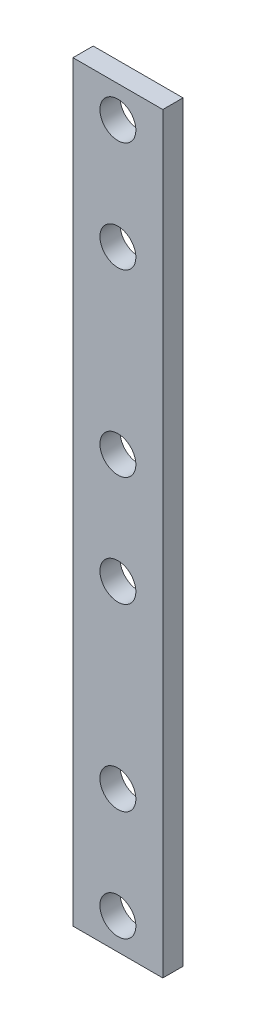
ISO-10303-21;
HEADER;
FILE_DESCRIPTION(('STEP AP214'),'2;1');
FILE_NAME('part.step','',(''),(''),'','','');
FILE_SCHEMA(('AUTOMOTIVE_DESIGN { 1 0 10303 214 1 1 1 1 }'));
ENDSEC;
DATA;
#1=APPLICATION_CONTEXT('core data for automotive mechanical design processes');
#2=APPLICATION_PROTOCOL_DEFINITION('international standard','automotive_design',2000,#1);
#3=PRODUCT_CONTEXT('',#1,'mechanical');
#4=PRODUCT('Part','Part','',(#3));
#5=PRODUCT_RELATED_PRODUCT_CATEGORY('part','',(#4));
#6=PRODUCT_DEFINITION_FORMATION('','',#4);
#7=PRODUCT_DEFINITION_CONTEXT('part definition',#1,'design');
#8=PRODUCT_DEFINITION('design','',#6,#7);
#9=PRODUCT_DEFINITION_SHAPE('','',#8);
#10=(LENGTH_UNIT() NAMED_UNIT(*) SI_UNIT(.MILLI.,.METRE.));
#11=(NAMED_UNIT(*) PLANE_ANGLE_UNIT() SI_UNIT($,.RADIAN.));
#12=(NAMED_UNIT(*) SI_UNIT($,.STERADIAN.) SOLID_ANGLE_UNIT());
#13=UNCERTAINTY_MEASURE_WITH_UNIT(LENGTH_MEASURE(1.E-05),#10,'distance_accuracy_value','');
#14=(GEOMETRIC_REPRESENTATION_CONTEXT(3) GLOBAL_UNCERTAINTY_ASSIGNED_CONTEXT((#13)) GLOBAL_UNIT_ASSIGNED_CONTEXT((#10,
#11,#12)) REPRESENTATION_CONTEXT('',''));
#15=CARTESIAN_POINT('',(0.,0.,0.));
#16=DIRECTION('',(0.,0.,1.));
#17=DIRECTION('',(1.,0.,0.));
#18=AXIS2_PLACEMENT_3D('',#15,#16,#17);
#19=CARTESIAN_POINT('',(36.3420104423946,-82.5000000000001,4.5));
#20=DIRECTION('',(-1.,0.,0.));
#21=DIRECTION('',(0.,0.,1.));
#22=AXIS2_PLACEMENT_3D('',#19,#20,#21);
#23=PLANE('',#22);
#24=DIRECTION('',(0.,1.,0.));
#25=VECTOR('',#24,1.);
#26=CARTESIAN_POINT('',(36.3420104423946,-82.5000000000001,0.));
#27=LINE('',#26,#25);
#28=CARTESIAN_POINT('',(36.3420104423946,-82.5000000000001,0.));
#29=VERTEX_POINT('',#28);
#30=CARTESIAN_POINT('',(36.3420104423946,84.9999999999999,0.));
#31=VERTEX_POINT('',#30);
#32=EDGE_CURVE('E96',#29,#31,#27,.T.);
#33=ORIENTED_EDGE('',*,*,#32,.T.);
#34=DIRECTION('',(0.,0.,-1.));
#35=VECTOR('',#34,1.);
#36=CARTESIAN_POINT('',(36.3420104423946,84.9999999999999,4.5));
#37=LINE('',#36,#35);
#38=CARTESIAN_POINT('',(36.3420104423946,84.9999999999999,4.5));
#39=VERTEX_POINT('',#38);
#40=EDGE_CURVE('E11',#39,#31,#37,.T.);
#41=ORIENTED_EDGE('',*,*,#40,.F.);
#42=DIRECTION('',(0.,1.,0.));
#43=VECTOR('',#42,1.);
#44=CARTESIAN_POINT('',(36.3420104423946,-82.5000000000001,4.5));
#45=LINE('',#44,#43);
#46=CARTESIAN_POINT('',(36.3420104423946,-82.5000000000001,4.5));
#47=VERTEX_POINT('',#46);
#48=EDGE_CURVE('E84',#47,#39,#45,.T.);
#49=ORIENTED_EDGE('',*,*,#48,.F.);
#50=DIRECTION('',(0.,0.,-1.));
#51=VECTOR('',#50,1.);
#52=CARTESIAN_POINT('',(36.3420104423946,-82.5000000000001,4.5));
#53=LINE('',#52,#51);
#54=EDGE_CURVE('E92',#47,#29,#53,.T.);
#55=ORIENTED_EDGE('',*,*,#54,.T.);
#56=EDGE_LOOP('',(#33,#41,#49,#55));
#57=FACE_BOUND('',#56,.T.);
#58=ADVANCED_FACE('F33',(#57),#23,.F.);
#59=CARTESIAN_POINT('',(36.3420104423946,84.9999999999999,4.5));
#60=DIRECTION('',(0.,-1.,0.));
#61=DIRECTION('',(0.,0.,-1.));
#62=AXIS2_PLACEMENT_3D('',#59,#60,#61);
#63=PLANE('',#62);
#64=DIRECTION('',(-1.,0.,0.));
#65=VECTOR('',#64,1.);
#66=CARTESIAN_POINT('',(36.3420104423946,84.9999999999999,0.));
#67=LINE('',#66,#65);
#68=CARTESIAN_POINT('',(16.3420104423947,84.9999999999999,0.));
#69=VERTEX_POINT('',#68);
#70=EDGE_CURVE('E88',#31,#69,#67,.T.);
#71=ORIENTED_EDGE('',*,*,#70,.T.);
#72=DIRECTION('',(0.,0.,-1.));
#73=VECTOR('',#72,1.);
#74=CARTESIAN_POINT('',(16.3420104423947,84.9999999999999,4.5));
#75=LINE('',#74,#73);
#76=CARTESIAN_POINT('',(16.3420104423947,84.9999999999999,4.5));
#77=VERTEX_POINT('',#76);
#78=EDGE_CURVE('E41',#77,#69,#75,.T.);
#79=ORIENTED_EDGE('',*,*,#78,.F.);
#80=DIRECTION('',(-1.,0.,0.));
#81=VECTOR('',#80,1.);
#82=CARTESIAN_POINT('',(36.3420104423946,84.9999999999999,4.5));
#83=LINE('',#82,#81);
#84=EDGE_CURVE('E79',#39,#77,#83,.T.);
#85=ORIENTED_EDGE('',*,*,#84,.F.);
#86=ORIENTED_EDGE('',*,*,#40,.T.);
#87=EDGE_LOOP('',(#71,#79,#85,#86));
#88=FACE_BOUND('',#87,.T.);
#89=ADVANCED_FACE('F87',(#88),#63,.F.);
#90=CARTESIAN_POINT('',(16.3420104423947,-82.5000000000001,4.5));
#91=DIRECTION('',(1.,0.,0.));
#92=DIRECTION('',(0.,0.,-1.));
#93=AXIS2_PLACEMENT_3D('',#90,#91,#92);
#94=PLANE('',#93);
#95=DIRECTION('',(0.,-1.,0.));
#96=VECTOR('',#95,1.);
#97=CARTESIAN_POINT('',(16.3420104423947,-82.5000000000001,0.));
#98=LINE('',#97,#96);
#99=CARTESIAN_POINT('',(16.3420104423947,-82.5000000000001,0.));
#100=VERTEX_POINT('',#99);
#101=EDGE_CURVE('E66',#69,#100,#98,.T.);
#102=ORIENTED_EDGE('',*,*,#101,.T.);
#103=DIRECTION('',(0.,0.,-1.));
#104=VECTOR('',#103,1.);
#105=CARTESIAN_POINT('',(16.3420104423947,-82.5000000000001,4.5));
#106=LINE('',#105,#104);
#107=CARTESIAN_POINT('',(16.3420104423947,-82.5000000000001,4.5));
#108=VERTEX_POINT('',#107);
#109=EDGE_CURVE('E89',#108,#100,#106,.T.);
#110=ORIENTED_EDGE('',*,*,#109,.F.);
#111=DIRECTION('',(0.,-1.,0.));
#112=VECTOR('',#111,1.);
#113=CARTESIAN_POINT('',(16.3420104423947,-82.5000000000001,4.5));
#114=LINE('',#113,#112);
#115=EDGE_CURVE('E82',#77,#108,#114,.T.);
#116=ORIENTED_EDGE('',*,*,#115,.F.);
#117=ORIENTED_EDGE('',*,*,#78,.T.);
#118=EDGE_LOOP('',(#102,#110,#116,#117));
#119=FACE_BOUND('',#118,.T.);
#120=ADVANCED_FACE('F90',(#119),#94,.F.);
#121=CARTESIAN_POINT('',(36.3420104423946,-82.5000000000001,4.5));
#122=DIRECTION('',(0.,1.,0.));
#123=DIRECTION('',(0.,0.,1.));
#124=AXIS2_PLACEMENT_3D('',#121,#122,#123);
#125=PLANE('',#124);
#126=DIRECTION('',(1.,0.,0.));
#127=VECTOR('',#126,1.);
#128=CARTESIAN_POINT('',(36.3420104423946,-82.5000000000001,0.));
#129=LINE('',#128,#127);
#130=EDGE_CURVE('E72',#100,#29,#129,.T.);
#131=ORIENTED_EDGE('',*,*,#130,.T.);
#132=ORIENTED_EDGE('',*,*,#54,.F.);
#133=DIRECTION('',(1.,0.,0.));
#134=VECTOR('',#133,1.);
#135=CARTESIAN_POINT('',(36.3420104423946,-82.5000000000001,4.5));
#136=LINE('',#135,#134);
#137=EDGE_CURVE('E49',#108,#47,#136,.T.);
#138=ORIENTED_EDGE('',*,*,#137,.F.);
#139=ORIENTED_EDGE('',*,*,#109,.T.);
#140=EDGE_LOOP('',(#131,#132,#138,#139));
#141=FACE_BOUND('',#140,.T.);
#142=ADVANCED_FACE('F104',(#141),#125,.F.);
#143=CARTESIAN_POINT('',(0.,0.,4.5));
#144=DIRECTION('',(0.,0.,1.));
#145=DIRECTION('',(1.,0.,0.));
#146=AXIS2_PLACEMENT_3D('',#143,#144,#145);
#147=PLANE('',#146);
#148=CARTESIAN_POINT('',(26.3420104423946,-75.5,4.5));
#149=DIRECTION('',(0.,0.,1.));
#150=DIRECTION('',(1.,0.,0.));
#151=AXIS2_PLACEMENT_3D('',#148,#149,#150);
#152=CIRCLE('',#151,4.);
#153=CARTESIAN_POINT('',(30.3420104423946,-75.5,4.5));
#154=VERTEX_POINT('',#153);
#155=EDGE_CURVE('E140',#154,#154,#152,.T.);
#156=ORIENTED_EDGE('',*,*,#155,.F.);
#157=EDGE_LOOP('',(#156));
#158=FACE_BOUND('',#157,.T.);
#159=CARTESIAN_POINT('',(26.3420104423946,-51.,4.5));
#160=DIRECTION('',(0.,0.,1.));
#161=DIRECTION('',(1.,0.,0.));
#162=AXIS2_PLACEMENT_3D('',#159,#160,#161);
#163=CIRCLE('',#162,4.);
#164=CARTESIAN_POINT('',(30.3420104423946,-51.,4.5));
#165=VERTEX_POINT('',#164);
#166=EDGE_CURVE('E137',#165,#165,#163,.T.);
#167=ORIENTED_EDGE('',*,*,#166,.F.);
#168=EDGE_LOOP('',(#167));
#169=FACE_BOUND('',#168,.T.);
#170=CARTESIAN_POINT('',(26.3420104423946,-11.,4.5));
#171=DIRECTION('',(0.,0.,1.));
#172=DIRECTION('',(1.,0.,0.));
#173=AXIS2_PLACEMENT_3D('',#170,#171,#172);
#174=CIRCLE('',#173,4.);
#175=CARTESIAN_POINT('',(30.3420104423946,-11.,4.5));
#176=VERTEX_POINT('',#175);
#177=EDGE_CURVE('E131',#176,#176,#174,.T.);
#178=ORIENTED_EDGE('',*,*,#177,.F.);
#179=EDGE_LOOP('',(#178));
#180=FACE_BOUND('',#179,.T.);
#181=CARTESIAN_POINT('',(26.3420104423947,13.5,4.5));
#182=DIRECTION('',(0.,0.,1.));
#183=DIRECTION('',(1.,0.,0.));
#184=AXIS2_PLACEMENT_3D('',#181,#182,#183);
#185=CIRCLE('',#184,4.);
#186=CARTESIAN_POINT('',(30.3420104423947,13.5,4.5));
#187=VERTEX_POINT('',#186);
#188=EDGE_CURVE('E125',#187,#187,#185,.T.);
#189=ORIENTED_EDGE('',*,*,#188,.F.);
#190=EDGE_LOOP('',(#189));
#191=FACE_BOUND('',#190,.T.);
#192=CARTESIAN_POINT('',(26.3420104423947,53.4999999999999,4.5));
#193=DIRECTION('',(0.,0.,1.));
#194=DIRECTION('',(1.,0.,0.));
#195=AXIS2_PLACEMENT_3D('',#192,#193,#194);
#196=CIRCLE('',#195,3.99999999999999);
#197=CARTESIAN_POINT('',(30.3420104423947,53.4999999999999,4.5));
#198=VERTEX_POINT('',#197);
#199=EDGE_CURVE('E119',#198,#198,#196,.T.);
#200=ORIENTED_EDGE('',*,*,#199,.F.);
#201=EDGE_LOOP('',(#200));
#202=FACE_BOUND('',#201,.T.);
#203=CARTESIAN_POINT('',(26.3420104423947,77.9999999999999,4.5));
#204=DIRECTION('',(0.,0.,1.));
#205=DIRECTION('',(1.,0.,0.));
#206=AXIS2_PLACEMENT_3D('',#203,#204,#205);
#207=CIRCLE('',#206,3.99999999999999);
#208=CARTESIAN_POINT('',(30.3420104423947,77.9999999999999,4.5));
#209=VERTEX_POINT('',#208);
#210=EDGE_CURVE('E113',#209,#209,#207,.T.);
#211=ORIENTED_EDGE('',*,*,#210,.F.);
#212=EDGE_LOOP('',(#211));
#213=FACE_BOUND('',#212,.T.);
#214=ORIENTED_EDGE('',*,*,#48,.T.);
#215=ORIENTED_EDGE('',*,*,#84,.T.);
#216=ORIENTED_EDGE('',*,*,#115,.T.);
#217=ORIENTED_EDGE('',*,*,#137,.T.);
#218=EDGE_LOOP('',(#214,#215,#216,#217));
#219=FACE_BOUND('',#218,.T.);
#220=ADVANCED_FACE('F80',(#158,#169,#180,#191,#202,#213,#219),#147,.T.);
#221=CARTESIAN_POINT('',(0.,0.,0.));
#222=DIRECTION('',(0.,0.,1.));
#223=DIRECTION('',(1.,0.,0.));
#224=AXIS2_PLACEMENT_3D('',#221,#222,#223);
#225=PLANE('',#224);
#226=CARTESIAN_POINT('',(26.3420104423946,-75.5,0.));
#227=DIRECTION('',(0.,0.,1.));
#228=DIRECTION('',(1.,0.,0.));
#229=AXIS2_PLACEMENT_3D('',#226,#227,#228);
#230=CIRCLE('',#229,4.);
#231=CARTESIAN_POINT('',(30.3420104423946,-75.5,0.));
#232=VERTEX_POINT('',#231);
#233=EDGE_CURVE('E99',#232,#232,#230,.T.);
#234=ORIENTED_EDGE('',*,*,#233,.T.);
#235=EDGE_LOOP('',(#234));
#236=FACE_BOUND('',#235,.T.);
#237=CARTESIAN_POINT('',(26.3420104423946,-51.,0.));
#238=DIRECTION('',(0.,0.,1.));
#239=DIRECTION('',(1.,0.,0.));
#240=AXIS2_PLACEMENT_3D('',#237,#238,#239);
#241=CIRCLE('',#240,4.);
#242=CARTESIAN_POINT('',(30.3420104423946,-51.,0.));
#243=VERTEX_POINT('',#242);
#244=EDGE_CURVE('E134',#243,#243,#241,.T.);
#245=ORIENTED_EDGE('',*,*,#244,.T.);
#246=EDGE_LOOP('',(#245));
#247=FACE_BOUND('',#246,.T.);
#248=CARTESIAN_POINT('',(26.3420104423946,-11.,0.));
#249=DIRECTION('',(0.,0.,1.));
#250=DIRECTION('',(1.,0.,0.));
#251=AXIS2_PLACEMENT_3D('',#248,#249,#250);
#252=CIRCLE('',#251,4.);
#253=CARTESIAN_POINT('',(30.3420104423946,-11.,0.));
#254=VERTEX_POINT('',#253);
#255=EDGE_CURVE('E128',#254,#254,#252,.T.);
#256=ORIENTED_EDGE('',*,*,#255,.T.);
#257=EDGE_LOOP('',(#256));
#258=FACE_BOUND('',#257,.T.);
#259=CARTESIAN_POINT('',(26.3420104423947,13.5,0.));
#260=DIRECTION('',(0.,0.,1.));
#261=DIRECTION('',(1.,0.,0.));
#262=AXIS2_PLACEMENT_3D('',#259,#260,#261);
#263=CIRCLE('',#262,4.);
#264=CARTESIAN_POINT('',(30.3420104423947,13.5,0.));
#265=VERTEX_POINT('',#264);
#266=EDGE_CURVE('E122',#265,#265,#263,.T.);
#267=ORIENTED_EDGE('',*,*,#266,.T.);
#268=EDGE_LOOP('',(#267));
#269=FACE_BOUND('',#268,.T.);
#270=CARTESIAN_POINT('',(26.3420104423947,53.4999999999999,0.));
#271=DIRECTION('',(0.,0.,1.));
#272=DIRECTION('',(1.,0.,0.));
#273=AXIS2_PLACEMENT_3D('',#270,#271,#272);
#274=CIRCLE('',#273,3.99999999999999);
#275=CARTESIAN_POINT('',(30.3420104423947,53.4999999999999,0.));
#276=VERTEX_POINT('',#275);
#277=EDGE_CURVE('E116',#276,#276,#274,.T.);
#278=ORIENTED_EDGE('',*,*,#277,.T.);
#279=EDGE_LOOP('',(#278));
#280=FACE_BOUND('',#279,.T.);
#281=CARTESIAN_POINT('',(26.3420104423947,77.9999999999999,0.));
#282=DIRECTION('',(0.,0.,1.));
#283=DIRECTION('',(1.,0.,0.));
#284=AXIS2_PLACEMENT_3D('',#281,#282,#283);
#285=CIRCLE('',#284,3.99999999999999);
#286=CARTESIAN_POINT('',(30.3420104423947,77.9999999999999,0.));
#287=VERTEX_POINT('',#286);
#288=EDGE_CURVE('E110',#287,#287,#285,.T.);
#289=ORIENTED_EDGE('',*,*,#288,.T.);
#290=EDGE_LOOP('',(#289));
#291=FACE_BOUND('',#290,.T.);
#292=ORIENTED_EDGE('',*,*,#32,.F.);
#293=ORIENTED_EDGE('',*,*,#130,.F.);
#294=ORIENTED_EDGE('',*,*,#101,.F.);
#295=ORIENTED_EDGE('',*,*,#70,.F.);
#296=EDGE_LOOP('',(#292,#293,#294,#295));
#297=FACE_BOUND('',#296,.T.);
#298=ADVANCED_FACE('F107',(#236,#247,#258,#269,#280,#291,#297),#225,.F.);
#299=CARTESIAN_POINT('',(26.3420104423947,77.9999999999999,0.));
#300=DIRECTION('',(0.,0.,1.));
#301=DIRECTION('',(1.,0.,0.));
#302=AXIS2_PLACEMENT_3D('',#299,#300,#301);
#303=CYLINDRICAL_SURFACE('',#302,3.99999999999999);
#304=ORIENTED_EDGE('',*,*,#288,.F.);
#305=EDGE_LOOP('',(#304));
#306=FACE_BOUND('',#305,.T.);
#307=ORIENTED_EDGE('',*,*,#210,.T.);
#308=EDGE_LOOP('',(#307));
#309=FACE_BOUND('',#308,.T.);
#310=ADVANCED_FACE('F168',(#306,#309),#303,.F.);
#311=CARTESIAN_POINT('',(26.3420104423947,53.4999999999999,0.));
#312=DIRECTION('',(0.,0.,1.));
#313=DIRECTION('',(1.,0.,0.));
#314=AXIS2_PLACEMENT_3D('',#311,#312,#313);
#315=CYLINDRICAL_SURFACE('',#314,3.99999999999999);
#316=ORIENTED_EDGE('',*,*,#277,.F.);
#317=EDGE_LOOP('',(#316));
#318=FACE_BOUND('',#317,.T.);
#319=ORIENTED_EDGE('',*,*,#199,.T.);
#320=EDGE_LOOP('',(#319));
#321=FACE_BOUND('',#320,.T.);
#322=ADVANCED_FACE('F170',(#318,#321),#315,.F.);
#323=CARTESIAN_POINT('',(26.3420104423947,13.5,0.));
#324=DIRECTION('',(0.,0.,1.));
#325=DIRECTION('',(1.,0.,0.));
#326=AXIS2_PLACEMENT_3D('',#323,#324,#325);
#327=CYLINDRICAL_SURFACE('',#326,4.);
#328=ORIENTED_EDGE('',*,*,#266,.F.);
#329=EDGE_LOOP('',(#328));
#330=FACE_BOUND('',#329,.T.);
#331=ORIENTED_EDGE('',*,*,#188,.T.);
#332=EDGE_LOOP('',(#331));
#333=FACE_BOUND('',#332,.T.);
#334=ADVANCED_FACE('F177',(#330,#333),#327,.F.);
#335=CARTESIAN_POINT('',(26.3420104423946,-11.,0.));
#336=DIRECTION('',(0.,0.,1.));
#337=DIRECTION('',(1.,0.,0.));
#338=AXIS2_PLACEMENT_3D('',#335,#336,#337);
#339=CYLINDRICAL_SURFACE('',#338,4.);
#340=ORIENTED_EDGE('',*,*,#255,.F.);
#341=EDGE_LOOP('',(#340));
#342=FACE_BOUND('',#341,.T.);
#343=ORIENTED_EDGE('',*,*,#177,.T.);
#344=EDGE_LOOP('',(#343));
#345=FACE_BOUND('',#344,.T.);
#346=ADVANCED_FACE('F223',(#342,#345),#339,.F.);
#347=CARTESIAN_POINT('',(26.3420104423946,-51.,0.));
#348=DIRECTION('',(0.,0.,1.));
#349=DIRECTION('',(1.,0.,0.));
#350=AXIS2_PLACEMENT_3D('',#347,#348,#349);
#351=CYLINDRICAL_SURFACE('',#350,4.);
#352=ORIENTED_EDGE('',*,*,#244,.F.);
#353=EDGE_LOOP('',(#352));
#354=FACE_BOUND('',#353,.T.);
#355=ORIENTED_EDGE('',*,*,#166,.T.);
#356=EDGE_LOOP('',(#355));
#357=FACE_BOUND('',#356,.T.);
#358=ADVANCED_FACE('F151',(#354,#357),#351,.F.);
#359=CARTESIAN_POINT('',(26.3420104423946,-75.5,0.));
#360=DIRECTION('',(0.,0.,1.));
#361=DIRECTION('',(1.,0.,0.));
#362=AXIS2_PLACEMENT_3D('',#359,#360,#361);
#363=CYLINDRICAL_SURFACE('',#362,4.);
#364=ORIENTED_EDGE('',*,*,#233,.F.);
#365=EDGE_LOOP('',(#364));
#366=FACE_BOUND('',#365,.T.);
#367=ORIENTED_EDGE('',*,*,#155,.T.);
#368=EDGE_LOOP('',(#367));
#369=FACE_BOUND('',#368,.T.);
#370=ADVANCED_FACE('F148',(#366,#369),#363,.F.);
#371=CLOSED_SHELL('',(#58,#89,#120,#142,#220,#298,#310,#322,#334,#346,#358,#370));
#372=MANIFOLD_SOLID_BREP('B2',#371);
#373=ADVANCED_BREP_SHAPE_REPRESENTATION('',(#18,#372),#14);
#374=SHAPE_DEFINITION_REPRESENTATION(#9,#373);
ENDSEC;
END-ISO-10303-21;
